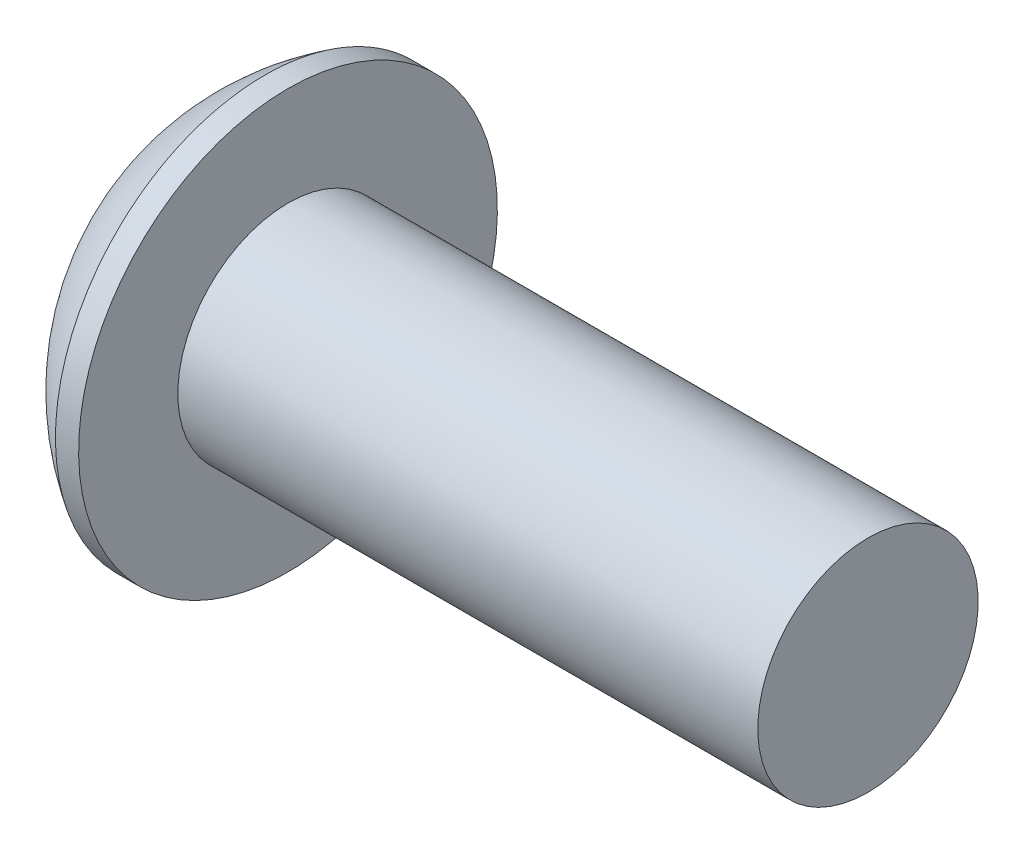
ISO-10303-21;
HEADER;
FILE_DESCRIPTION(('STEP AP214'),'2;1');
FILE_NAME('part.step','',(''),(''),'','','');
FILE_SCHEMA(('AUTOMOTIVE_DESIGN { 1 0 10303 214 1 1 1 1 }'));
ENDSEC;
DATA;
#1=APPLICATION_CONTEXT('core data for automotive mechanical design processes');
#2=APPLICATION_PROTOCOL_DEFINITION('international standard','automotive_design',2000,#1);
#3=PRODUCT_CONTEXT('',#1,'mechanical');
#4=PRODUCT('Part','Part','',(#3));
#5=PRODUCT_RELATED_PRODUCT_CATEGORY('part','',(#4));
#6=PRODUCT_DEFINITION_FORMATION('','',#4);
#7=PRODUCT_DEFINITION_CONTEXT('part definition',#1,'design');
#8=PRODUCT_DEFINITION('design','',#6,#7);
#9=PRODUCT_DEFINITION_SHAPE('','',#8);
#10=(LENGTH_UNIT() NAMED_UNIT(*) SI_UNIT(.MILLI.,.METRE.));
#11=(NAMED_UNIT(*) PLANE_ANGLE_UNIT() SI_UNIT($,.RADIAN.));
#12=(NAMED_UNIT(*) SI_UNIT($,.STERADIAN.) SOLID_ANGLE_UNIT());
#13=UNCERTAINTY_MEASURE_WITH_UNIT(LENGTH_MEASURE(1.E-05),#10,'distance_accuracy_value','');
#14=(GEOMETRIC_REPRESENTATION_CONTEXT(3) GLOBAL_UNCERTAINTY_ASSIGNED_CONTEXT((#13)) GLOBAL_UNIT_ASSIGNED_CONTEXT((#10,
#11,#12)) REPRESENTATION_CONTEXT('',''));
#15=CARTESIAN_POINT('',(0.,0.,0.));
#16=DIRECTION('',(0.,0.,1.));
#17=DIRECTION('',(1.,0.,0.));
#18=AXIS2_PLACEMENT_3D('',#15,#16,#17);
#19=CARTESIAN_POINT('',(-0.533400000000002,0.,0.));
#20=DIRECTION('',(-1.,0.,0.));
#21=DIRECTION('',(0.,0.,1.));
#22=AXIS2_PLACEMENT_3D('',#19,#20,#21);
#23=PLANE('',#22);
#24=DIRECTION('',(0.,0.5,0.866025403784439));
#25=VECTOR('',#24,1.);
#26=CARTESIAN_POINT('',(-0.533400000000002,1.83308710467706,0.));
#27=LINE('',#26,#25);
#28=CARTESIAN_POINT('',(-0.533400000000002,1.83308710467706,0.));
#29=VERTEX_POINT('',#28);
#30=CARTESIAN_POINT('',(-0.533400000000002,0.916543552338531,-1.5875));
#31=VERTEX_POINT('',#30);
#32=EDGE_CURVE('E114',#29,#31,#27,.F.);
#33=ORIENTED_EDGE('',*,*,#32,.T.);
#34=DIRECTION('',(0.,1.,0.));
#35=VECTOR('',#34,1.);
#36=CARTESIAN_POINT('',(-0.533400000000002,0.916543552338531,-1.5875));
#37=LINE('',#36,#35);
#38=CARTESIAN_POINT('',(-0.533400000000002,-0.916543552338531,-1.5875));
#39=VERTEX_POINT('',#38);
#40=EDGE_CURVE('E81',#31,#39,#37,.F.);
#41=ORIENTED_EDGE('',*,*,#40,.T.);
#42=DIRECTION('',(0.,0.5,-0.866025403784439));
#43=VECTOR('',#42,1.);
#44=CARTESIAN_POINT('',(-0.533400000000002,-0.916543552338531,-1.5875));
#45=LINE('',#44,#43);
#46=CARTESIAN_POINT('',(-0.533400000000002,-1.83308710467706,0.));
#47=VERTEX_POINT('',#46);
#48=EDGE_CURVE('E83',#39,#47,#45,.F.);
#49=ORIENTED_EDGE('',*,*,#48,.T.);
#50=DIRECTION('',(0.,-0.5,-0.866025403784439));
#51=VECTOR('',#50,1.);
#52=CARTESIAN_POINT('',(-0.533400000000002,-1.83308710467706,0.));
#53=LINE('',#52,#51);
#54=CARTESIAN_POINT('',(-0.533400000000002,-0.916543552338533,1.5875));
#55=VERTEX_POINT('',#54);
#56=EDGE_CURVE('E84',#47,#55,#53,.F.);
#57=ORIENTED_EDGE('',*,*,#56,.T.);
#58=DIRECTION('',(0.,-1.,0.));
#59=VECTOR('',#58,1.);
#60=CARTESIAN_POINT('',(-0.533400000000002,-0.916543552338532,1.5875));
#61=LINE('',#60,#59);
#62=CARTESIAN_POINT('',(-0.533400000000002,0.916543552338531,1.5875));
#63=VERTEX_POINT('',#62);
#64=EDGE_CURVE('E70',#55,#63,#61,.F.);
#65=ORIENTED_EDGE('',*,*,#64,.T.);
#66=DIRECTION('',(0.,-0.5,0.866025403784439));
#67=VECTOR('',#66,1.);
#68=CARTESIAN_POINT('',(-0.533400000000002,0.916543552338531,1.5875));
#69=LINE('',#68,#67);
#70=EDGE_CURVE('E109',#63,#29,#69,.F.);
#71=ORIENTED_EDGE('',*,*,#70,.T.);
#72=EDGE_LOOP('',(#33,#41,#49,#57,#65,#71));
#73=FACE_BOUND('',#72,.T.);
#74=ADVANCED_FACE('F16',(#73),#23,.T.);
#75=CARTESIAN_POINT('',(-0.533400000000002,-1.83308710467706,0.));
#76=DIRECTION('',(0.,-0.866025403784439,0.5));
#77=DIRECTION('',(0.,-0.5,-0.866025403784439));
#78=AXIS2_PLACEMENT_3D('',#75,#76,#77);
#79=PLANE('',#78);
#80=CARTESIAN_POINT('',(-2.56539999994394,-1.8330871046745,-2.00804498786736E-11));
#81=CARTESIAN_POINT('',(-2.53392818229741,-1.80158505518366,0.0545631502562923));
#82=CARTESIAN_POINT('',(-2.5043050627177,-1.76955629074211,0.110038597579172));
#83=CARTESIAN_POINT('',(-2.45006639539122,-1.70424635317817,0.223158727683824));
#84=CARTESIAN_POINT('',(-2.42548101615987,-1.6709589724711,0.280814162317604));
#85=CARTESIAN_POINT('',(-2.38336609605347,-1.60383660211837,0.397073518091736));
#86=CARTESIAN_POINT('',(-2.36573072948629,-1.57001869730198,0.455647847439699));
#87=CARTESIAN_POINT('',(-2.33856008862263,-1.50163859306838,0.574085662199493));
#88=CARTESIAN_POINT('',(-2.32900454007239,-1.46707848106388,0.633945532106421));
#89=CARTESIAN_POINT('',(-2.32038274183869,-1.40751253669323,0.737116774157155));
#90=CARTESIAN_POINT('',(-2.31910682172836,-1.38258360390154,0.780294952330845));
#91=CARTESIAN_POINT('',(-2.32125913780735,-1.33276652395073,0.866580665890379));
#92=CARTESIAN_POINT('',(-2.32468902284537,-1.30787839414808,0.90968817121394));
#93=CARTESIAN_POINT('',(-2.33605631415915,-1.25834345643267,0.995485200086784));
#94=CARTESIAN_POINT('',(-2.34399762019329,-1.23369687609494,1.03817432946455));
#95=CARTESIAN_POINT('',(-2.36395627681902,-1.18481740842653,1.12283605091316));
#96=CARTESIAN_POINT('',(-2.37597537628367,-1.16058470328902,1.16480832741616));
#97=CARTESIAN_POINT('',(-2.41164383187845,-1.09853862948576,1.27227527965358));
#98=CARTESIAN_POINT('',(-2.43797770752625,-1.06110942924036,1.33710455616529));
#99=CARTESIAN_POINT('',(-2.48243061452926,-1.00607390269188,1.43242888436855));
#100=CARTESIAN_POINT('',(-2.49804835924321,-0.987937988038022,1.46384120999077));
#101=CARTESIAN_POINT('',(-2.53070945051393,-0.951999508520197,1.52608848246242));
#102=CARTESIAN_POINT('',(-2.54775211871235,-0.934196789917587,1.55692369559499));
#103=CARTESIAN_POINT('',(-2.56539999993807,-0.916543552329633,1.58750000001541));
#104=B_SPLINE_CURVE_WITH_KNOTS('',3,(#80,#81,#82,#83,#84,#85,#86,#87,#88,#89,#90,#91,#92,#93,
#94,#95,#96,#97,#98,#99,#100,#101,#102,#103),.UNSPECIFIED.,.F.,.F.,(4,2,2,2,2,2,2,2,2,2,2,4),
(0.,0.211427927732169,0.424087197148228,0.633370156422424,0.842126401515785,0.991537201098734,
1.14100036552056,1.29059292577265,1.44024972414947,1.67781721417335,1.79627069411587,
1.91466809995991),.UNSPECIFIED.);
#105=CARTESIAN_POINT('',(-2.56539999993857,-1.83308710468646,0.));
#106=VERTEX_POINT('',#105);
#107=CARTESIAN_POINT('',(-2.56539999993106,-0.916543552342318,1.5875));
#108=VERTEX_POINT('',#107);
#109=EDGE_CURVE('E19',#106,#108,#104,.T.);
#110=ORIENTED_EDGE('',*,*,#109,.T.);
#111=DIRECTION('',(1.,0.,0.));
#112=VECTOR('',#111,1.);
#113=CARTESIAN_POINT('',(-0.533400000000002,-0.916543552338533,1.5875));
#114=LINE('',#113,#112);
#115=EDGE_CURVE('E89',#108,#55,#114,.T.);
#116=ORIENTED_EDGE('',*,*,#115,.T.);
#117=ORIENTED_EDGE('',*,*,#56,.F.);
#118=DIRECTION('',(1.,0.,0.));
#119=VECTOR('',#118,1.);
#120=CARTESIAN_POINT('',(-0.533400000000002,-1.83308710467706,0.));
#121=LINE('',#120,#119);
#122=EDGE_CURVE('E57',#47,#106,#121,.F.);
#123=ORIENTED_EDGE('',*,*,#122,.T.);
#124=EDGE_LOOP('',(#110,#116,#117,#123));
#125=FACE_BOUND('',#124,.T.);
#126=ADVANCED_FACE('F88',(#125),#79,.F.);
#127=CARTESIAN_POINT('',(-0.533400000000002,-0.916543552338531,-1.5875));
#128=DIRECTION('',(0.,-0.866025403784439,-0.5));
#129=DIRECTION('',(0.,0.5,-0.866025403784439));
#130=AXIS2_PLACEMENT_3D('',#127,#128,#129);
#131=PLANE('',#130);
#132=CARTESIAN_POINT('',(-2.56539999994527,-0.916543552319403,-1.58750000001409));
#133=CARTESIAN_POINT('',(-2.53392818229919,-0.948045601822691,-1.53293684974403));
#134=CARTESIAN_POINT('',(-2.50430506271949,-0.980074366269487,-1.47746140242354));
#135=CARTESIAN_POINT('',(-2.45006639539264,-1.04538430383757,-1.36434127232016));
#136=CARTESIAN_POINT('',(-2.42548101616093,-1.07867168454351,-1.30668583768523));
#137=CARTESIAN_POINT('',(-2.38336609605398,-1.14579405489574,-1.19042648190974));
#138=CARTESIAN_POINT('',(-2.36573072948662,-1.17961195971273,-1.13185215256154));
#139=CARTESIAN_POINT('',(-2.3385600886227,-1.2479920639471,-1.013414337801));
#140=CARTESIAN_POINT('',(-2.32900454007237,-1.28255217595175,-0.953554467893575));
#141=CARTESIAN_POINT('',(-2.32038274183866,-1.34211812032265,-0.850383225842316));
#142=CARTESIAN_POINT('',(-2.31910682172835,-1.36704705311438,-0.807205047668587));
#143=CARTESIAN_POINT('',(-2.32125913780739,-1.41686413306525,-0.720919334108961));
#144=CARTESIAN_POINT('',(-2.32468902284544,-1.44175226286793,-0.67781182878535));
#145=CARTESIAN_POINT('',(-2.33605631415929,-1.49128720058339,-0.592014799912417));
#146=CARTESIAN_POINT('',(-2.34399762019345,-1.51593378092113,-0.54932567053461));
#147=CARTESIAN_POINT('',(-2.36395627681926,-1.56481324858959,-0.464663949085931));
#148=CARTESIAN_POINT('',(-2.37597537628395,-1.58904595372712,-0.422691672582891));
#149=CARTESIAN_POINT('',(-2.41164383187876,-1.65109202753029,-0.315224720345625));
#150=CARTESIAN_POINT('',(-2.43797770752652,-1.6885212277756,-0.250395443834082));
#151=CARTESIAN_POINT('',(-2.48243061452944,-1.74355675432393,-0.15507111563107));
#152=CARTESIAN_POINT('',(-2.49804835924337,-1.76169266897775,-0.123658790008927));
#153=CARTESIAN_POINT('',(-2.53070945051401,-1.79763114849548,-0.0614115175374324));
#154=CARTESIAN_POINT('',(-2.5477521187124,-1.81543386709805,-0.0305763044049344));
#155=CARTESIAN_POINT('',(-2.56539999993807,-1.83308710468596,1.54136844652939E-11));
#156=B_SPLINE_CURVE_WITH_KNOTS('',3,(#132,#133,#134,#135,#136,#137,#138,#139,#140,#141,#142,
#143,#144,#145,#146,#147,#148,#149,#150,#151,#152,#153,#154,#155),.UNSPECIFIED.,.F.,.F.,(4,2,2,
2,2,2,2,2,2,2,2,4),(0.,0.211427927733669,0.424087197151313,0.633370156427101,0.842126401522016,
0.99153720110513,1.14100036552713,1.29059292577937,1.44024972415633,1.67781721417961,
1.79627069412184,1.9146680999656),.UNSPECIFIED.);
#157=CARTESIAN_POINT('',(-2.56539999995198,-0.916543552351339,-1.58750000002218));
#158=VERTEX_POINT('',#157);
#159=EDGE_CURVE('E93',#158,#106,#156,.T.);
#160=ORIENTED_EDGE('',*,*,#159,.T.);
#161=ORIENTED_EDGE('',*,*,#122,.F.);
#162=ORIENTED_EDGE('',*,*,#48,.F.);
#163=DIRECTION('',(-1.,0.,0.));
#164=VECTOR('',#163,1.);
#165=CARTESIAN_POINT('',(-0.533400000000002,-0.916543552338531,-1.5875));
#166=LINE('',#165,#164);
#167=EDGE_CURVE('E95',#39,#158,#166,.T.);
#168=ORIENTED_EDGE('',*,*,#167,.T.);
#169=EDGE_LOOP('',(#160,#161,#162,#168));
#170=FACE_BOUND('',#169,.T.);
#171=ADVANCED_FACE('F91',(#170),#131,.F.);
#172=CARTESIAN_POINT('',(-0.533400000000002,0.916543552338531,-1.5875));
#173=DIRECTION('',(0.,0.,-1.));
#174=DIRECTION('',(-1.,0.,0.));
#175=AXIS2_PLACEMENT_3D('',#172,#173,#174);
#176=PLANE('',#175);
#177=CARTESIAN_POINT('',(-2.56539999994527,0.916543552360294,-1.58749999999048));
#178=CARTESIAN_POINT('',(-2.53392818229821,0.853539453376781,-1.58749999999657));
#179=CARTESIAN_POINT('',(-2.50430506271702,0.789481924500113,-1.58749999999908));
#180=CARTESIAN_POINT('',(-2.45006639538581,0.658862049392287,-1.58750000000093));
#181=CARTESIAN_POINT('',(-2.42548101615122,0.59228728799181,-1.58750000000025));
#182=CARTESIAN_POINT('',(-2.38336609603683,0.458042547310979,-1.58749999999976));
#183=CARTESIAN_POINT('',(-2.36573072946494,0.390406737689213,-1.58749999999994));
#184=CARTESIAN_POINT('',(-2.3385600885904,0.253646529243895,-1.58750000000006));
#185=CARTESIAN_POINT('',(-2.32900454003397,0.184526305245804,-1.58750000000001));
#186=CARTESIAN_POINT('',(-2.32038274178942,0.0653944165301613,-1.58749999999999));
#187=CARTESIAN_POINT('',(-2.31910682167392,0.0155365509618711,-1.5875));
#188=CARTESIAN_POINT('',(-2.3212591377409,-0.0840976089101244,-1.5875));
#189=CARTESIAN_POINT('',(-2.32468902277208,-0.133873868500894,-1.5875));
#190=CARTESIAN_POINT('',(-2.33605631407098,-0.2329437439033,-1.5875));
#191=CARTESIAN_POINT('',(-2.34399762009707,-0.282236904564879,-1.5875));
#192=CARTESIAN_POINT('',(-2.36395627670599,-0.379995839874564,-1.5875));
#193=CARTESIAN_POINT('',(-2.37597537616188,-0.428461250136325,-1.5875));
#194=CARTESIAN_POINT('',(-2.41164383175616,-0.552553397787632,-1.5875));
#195=CARTESIAN_POINT('',(-2.43797770742117,-0.627411798334259,-1.5875));
#196=CARTESIAN_POINT('',(-2.48243061445881,-0.737482851511091,-1.5875));
#197=CARTESIAN_POINT('',(-2.49804835918582,-0.773754680844889,-1.5875));
#198=CARTESIAN_POINT('',(-2.53070945048496,-0.845631639931401,-1.5875));
#199=CARTESIAN_POINT('',(-2.54775211869874,-0.881237077161412,-1.5875));
#200=CARTESIAN_POINT('',(-2.56539999994071,-0.916543552361606,-1.5875));
#201=B_SPLINE_CURVE_WITH_KNOTS('',3,(#177,#178,#179,#180,#181,#182,#183,#184,#185,#186,#187,
#188,#189,#190,#191,#192,#193,#194,#195,#196,#197,#198,#199,#200),.UNSPECIFIED.,.F.,.F.,(4,2,2,
2,2,2,2,2,2,2,2,4),(0.,0.211427927701375,0.424087197086717,0.633370156331471,0.842126401395377,
0.991537200933545,1.14100036531054,1.29059292551773,1.44024972384963,1.677817214047,
1.79627069407681,1.91466810000777),.UNSPECIFIED.);
#202=CARTESIAN_POINT('',(-2.56539999995198,0.916543552337129,-1.58749999999757));
#203=VERTEX_POINT('',#202);
#204=EDGE_CURVE('E197',#203,#158,#201,.T.);
#205=ORIENTED_EDGE('',*,*,#204,.T.);
#206=ORIENTED_EDGE('',*,*,#167,.F.);
#207=ORIENTED_EDGE('',*,*,#40,.F.);
#208=DIRECTION('',(1.,0.,0.));
#209=VECTOR('',#208,1.);
#210=CARTESIAN_POINT('',(-0.533400000000002,0.916543552338531,-1.5875));
#211=LINE('',#210,#209);
#212=EDGE_CURVE('E111',#31,#203,#211,.F.);
#213=ORIENTED_EDGE('',*,*,#212,.T.);
#214=EDGE_LOOP('',(#205,#206,#207,#213));
#215=FACE_BOUND('',#214,.T.);
#216=ADVANCED_FACE('F187',(#215),#176,.F.);
#217=CARTESIAN_POINT('',(-0.533400000000002,1.83308710467706,0.));
#218=DIRECTION('',(0.,0.866025403784439,-0.5));
#219=DIRECTION('',(0.,0.5,0.866025403784439));
#220=AXIS2_PLACEMENT_3D('',#217,#218,#219);
#221=PLANE('',#220);
#222=CARTESIAN_POINT('',(-2.56539999994394,1.8330871046745,2.00800374309997E-11));
#223=CARTESIAN_POINT('',(-2.5339281822974,1.80158505518366,-0.0545631502562965));
#224=CARTESIAN_POINT('',(-2.5043050627177,1.76955629074211,-0.11003859757918));
#225=CARTESIAN_POINT('',(-2.45006639539121,1.70424635317816,-0.22315872768384));
#226=CARTESIAN_POINT('',(-2.42548101615987,1.67095897247109,-0.280814162317626));
#227=CARTESIAN_POINT('',(-2.38336609605347,1.60383660211835,-0.397073518091758));
#228=CARTESIAN_POINT('',(-2.36573072948628,1.57001869730197,-0.455647847439717));
#229=CARTESIAN_POINT('',(-2.33856008862263,1.50163859306837,-0.574085662199503));
#230=CARTESIAN_POINT('',(-2.32900454007239,1.46707848106388,-0.633945532106426));
#231=CARTESIAN_POINT('',(-2.32038274183869,1.40751253669322,-0.737116774157154));
#232=CARTESIAN_POINT('',(-2.31910682172836,1.38258360390154,-0.780294952330843));
#233=CARTESIAN_POINT('',(-2.32125913780735,1.33276652395073,-0.866580665890374));
#234=CARTESIAN_POINT('',(-2.32468902284537,1.30787839414808,-0.909688171213933));
#235=CARTESIAN_POINT('',(-2.33605631415915,1.25834345643267,-0.995485200086777));
#236=CARTESIAN_POINT('',(-2.34399762019328,1.23369687609495,-1.03817432946455));
#237=CARTESIAN_POINT('',(-2.36395627681902,1.18481740842653,-1.12283605091316));
#238=CARTESIAN_POINT('',(-2.37597537628367,1.16058470328902,-1.16480832741616));
#239=CARTESIAN_POINT('',(-2.41164383187872,1.09853862948529,-1.2722752796544));
#240=CARTESIAN_POINT('',(-2.43797770752691,1.06110942923942,-1.33710455616691));
#241=CARTESIAN_POINT('',(-2.48243061453059,1.00607390269029,-1.43242888437131));
#242=CARTESIAN_POINT('',(-2.49804835924479,0.987937988036214,-1.4638412099939));
#243=CARTESIAN_POINT('',(-2.53070945051602,0.951999508517968,-1.52608848246628));
#244=CARTESIAN_POINT('',(-2.54775211871471,0.934196789915152,-1.55692369559921));
#245=CARTESIAN_POINT('',(-2.56539999994071,0.916543552326994,-1.58750000001998));
#246=B_SPLINE_CURVE_WITH_KNOTS('',3,(#222,#223,#224,#225,#226,#227,#228,#229,#230,#231,#232,
#233,#234,#235,#236,#237,#238,#239,#240,#241,#242,#243,#244,#245),.UNSPECIFIED.,.F.,.F.,(4,2,2,
2,2,2,2,2,2,2,2,4),(0.,0.211427927732185,0.424087197148259,0.63337015642244,0.842126401515786,
0.99153720109873,1.14100036552055,1.29059292577265,1.44024972414947,1.67781721417631,
1.7962706941203,1.9146680999658),.UNSPECIFIED.);
#247=CARTESIAN_POINT('',(-2.56539999993857,1.83308710468646,0.));
#248=VERTEX_POINT('',#247);
#249=EDGE_CURVE('E191',#248,#203,#246,.T.);
#250=ORIENTED_EDGE('',*,*,#249,.T.);
#251=ORIENTED_EDGE('',*,*,#212,.F.);
#252=ORIENTED_EDGE('',*,*,#32,.F.);
#253=DIRECTION('',(1.,0.,0.));
#254=VECTOR('',#253,1.);
#255=CARTESIAN_POINT('',(-0.533400000000002,1.83308710467706,0.));
#256=LINE('',#255,#254);
#257=EDGE_CURVE('E106',#29,#248,#256,.F.);
#258=ORIENTED_EDGE('',*,*,#257,.T.);
#259=EDGE_LOOP('',(#250,#251,#252,#258));
#260=FACE_BOUND('',#259,.T.);
#261=ADVANCED_FACE('F183',(#260),#221,.F.);
#262=CARTESIAN_POINT('',(-0.533400000000002,0.916543552338531,1.5875));
#263=DIRECTION('',(0.,0.866025403784439,0.5));
#264=DIRECTION('',(0.,-0.5,0.866025403784439));
#265=AXIS2_PLACEMENT_3D('',#262,#263,#264);
#266=PLANE('',#265);
#267=CARTESIAN_POINT('',(-2.56539999994394,0.91654355231986,1.58750000000782));
#268=CARTESIAN_POINT('',(-2.53392818229741,0.948045601824288,1.5329368497393));
#269=CARTESIAN_POINT('',(-2.5043050627177,0.980074366271431,1.47746140241964));
#270=CARTESIAN_POINT('',(-2.45006639539122,1.04538430383949,1.36434127231737));
#271=CARTESIAN_POINT('',(-2.42548101615987,1.07867168454504,1.30668583768271));
#272=CARTESIAN_POINT('',(-2.38336609605347,1.14579405489669,1.19042648190795));
#273=CARTESIAN_POINT('',(-2.36573072948629,1.17961195971347,1.13185215256022));
#274=CARTESIAN_POINT('',(-2.33856008862263,1.24799206394736,1.01341433780059));
#275=CARTESIAN_POINT('',(-2.32900454007239,1.28255217595174,0.953554467893597));
#276=CARTESIAN_POINT('',(-2.32038274183869,1.34211812032234,0.850383225842832));
#277=CARTESIAN_POINT('',(-2.31910682172836,1.36704705311405,0.807205047669152));
#278=CARTESIAN_POINT('',(-2.32125913780735,1.41686413306487,0.720919334109624));
#279=CARTESIAN_POINT('',(-2.32468902284537,1.44175226286752,0.677811828786061));
#280=CARTESIAN_POINT('',(-2.33605631415915,1.49128720058292,0.592014799913215));
#281=CARTESIAN_POINT('',(-2.34399762019328,1.51593378092065,0.549325670535446));
#282=CARTESIAN_POINT('',(-2.36395627681902,1.56481324858906,0.464663949086841));
#283=CARTESIAN_POINT('',(-2.37597537628367,1.58904595372657,0.422691672583837));
#284=CARTESIAN_POINT('',(-2.41164383187845,1.65109202752983,0.315224720346425));
#285=CARTESIAN_POINT('',(-2.43797770752625,1.68852122777524,0.250395443834706));
#286=CARTESIAN_POINT('',(-2.48243061452926,1.74355675432371,0.155071115631445));
#287=CARTESIAN_POINT('',(-2.49804835924321,1.76169266897757,0.123658790009225));
#288=CARTESIAN_POINT('',(-2.53070945051393,1.7976311484954,0.0614115175375789));
#289=CARTESIAN_POINT('',(-2.54775211871235,1.81543386709801,0.0305763044050067));
#290=CARTESIAN_POINT('',(-2.56539999993807,1.83308710468596,-1.54142580803093E-11));
#291=B_SPLINE_CURVE_WITH_KNOTS('',3,(#267,#268,#269,#270,#271,#272,#273,#274,#275,#276,#277,
#278,#279,#280,#281,#282,#283,#284,#285,#286,#287,#288,#289,#290),.UNSPECIFIED.,.F.,.F.,(4,2,2,
2,2,2,2,2,2,2,2,4),(0.,0.211427927732169,0.424087197148227,0.633370156422423,0.842126401515785,
0.991537201098733,1.14100036552056,1.29059292577265,1.44024972414946,1.67781721417335,
1.79627069411587,1.91466809995991),.UNSPECIFIED.);
#292=CARTESIAN_POINT('',(-2.56539999993857,0.91654355234323,1.58750000000814));
#293=VERTEX_POINT('',#292);
#294=EDGE_CURVE('E165',#293,#248,#291,.T.);
#295=ORIENTED_EDGE('',*,*,#294,.T.);
#296=ORIENTED_EDGE('',*,*,#257,.F.);
#297=ORIENTED_EDGE('',*,*,#70,.F.);
#298=DIRECTION('',(1.,0.,0.));
#299=VECTOR('',#298,1.);
#300=CARTESIAN_POINT('',(-0.533400000000002,0.916543552338531,1.5875));
#301=LINE('',#300,#299);
#302=EDGE_CURVE('E38',#63,#293,#301,.F.);
#303=ORIENTED_EDGE('',*,*,#302,.T.);
#304=EDGE_LOOP('',(#295,#296,#297,#303));
#305=FACE_BOUND('',#304,.T.);
#306=ADVANCED_FACE('F176',(#305),#266,.F.);
#307=CARTESIAN_POINT('',(-0.533400000000002,-0.916543552338532,1.5875));
#308=DIRECTION('',(0.,0.,1.));
#309=DIRECTION('',(0.,-1.,0.));
#310=AXIS2_PLACEMENT_3D('',#307,#308,#309);
#311=PLANE('',#310);
#312=CARTESIAN_POINT('',(-2.56539999994394,-0.916543552354642,1.58749999998774));
#313=CARTESIAN_POINT('',(-2.53392818229741,-0.853539453359365,1.58749999999559));
#314=CARTESIAN_POINT('',(-2.50430506271771,-0.789481924470656,1.58749999999882));
#315=CARTESIAN_POINT('',(-2.45006639539122,-0.658862049338629,1.58750000000119));
#316=CARTESIAN_POINT('',(-2.42548101615988,-0.592287287925995,1.58750000000032));
#317=CARTESIAN_POINT('',(-2.38336609605349,-0.458042547221593,1.58749999999969));
#318=CARTESIAN_POINT('',(-2.36573072948631,-0.390406737588416,1.58749999999992));
#319=CARTESIAN_POINT('',(-2.33856008862266,-0.253646529120892,1.58750000000008));
#320=CARTESIAN_POINT('',(-2.32900454007243,-0.184526305112002,1.58750000000002));
#321=CARTESIAN_POINT('',(-2.32038274183874,-0.065394416370719,1.58749999999999));
#322=CARTESIAN_POINT('',(-2.31910682172841,-0.0155365507873145,1.5875));
#323=CARTESIAN_POINT('',(-2.32125913780742,0.0840976091143436,1.5875));
#324=CARTESIAN_POINT('',(-2.32468902284545,0.133873868719661,1.5875));
#325=CARTESIAN_POINT('',(-2.33605631415924,0.232943744150505,1.5875));
#326=CARTESIAN_POINT('',(-2.34399762019338,0.282236904825971,1.5875));
#327=CARTESIAN_POINT('',(-2.36395627681913,0.379995840162817,1.5875));
#328=CARTESIAN_POINT('',(-2.37597537628379,0.428461250437852,1.5875));
#329=CARTESIAN_POINT('',(-2.41164383187857,0.552553398044325,1.5875));
#330=CARTESIAN_POINT('',(-2.43797770752636,0.627411798535089,1.5875));
#331=CARTESIAN_POINT('',(-2.48243061452933,0.737482851631955,1.5875));
#332=CARTESIAN_POINT('',(-2.49804835924327,0.773754680939651,1.5875));
#333=CARTESIAN_POINT('',(-2.53070945051396,0.84563163997525,1.5875));
#334=CARTESIAN_POINT('',(-2.54775211871237,0.881237077180446,1.5875));
#335=CARTESIAN_POINT('',(-2.56539999993807,0.91654355235633,1.5875));
#336=B_SPLINE_CURVE_WITH_KNOTS('',3,(#312,#313,#314,#315,#316,#317,#318,#319,#320,#321,#322,
#323,#324,#325,#326,#327,#328,#329,#330,#331,#332,#333,#334,#335),.UNSPECIFIED.,.F.,.F.,(4,2,2,
2,2,2,2,2,2,2,2,4),(0.,0.211427927732202,0.424087197148294,0.633370156422521,0.842126401515914,
0.991537201098908,1.14100036552078,1.29059292577292,1.44024972414978,1.67781721417349,
1.79627069411592,1.91466809995988),.UNSPECIFIED.);
#337=EDGE_CURVE('E157',#108,#293,#336,.T.);
#338=ORIENTED_EDGE('',*,*,#337,.T.);
#339=ORIENTED_EDGE('',*,*,#302,.F.);
#340=ORIENTED_EDGE('',*,*,#64,.F.);
#341=ORIENTED_EDGE('',*,*,#115,.F.);
#342=EDGE_LOOP('',(#338,#339,#340,#341));
#343=FACE_BOUND('',#342,.T.);
#344=ADVANCED_FACE('F172',(#343),#311,.F.);
#345=CARTESIAN_POINT('',(-2.56540000003724,0.,0.));
#346=DIRECTION('',(-1.,0.,0.));
#347=DIRECTION('',(0.,-1.,0.));
#348=AXIS2_PLACEMENT_3D('',#345,#346,#347);
#349=CONICAL_SURFACE('',#348,1.83308710478514,0.78539816351237);
#350=ORIENTED_EDGE('',*,*,#109,.F.);
#351=CARTESIAN_POINT('',(-2.56539999992356,0.,0.));
#352=DIRECTION('',(-1.,0.,0.));
#353=DIRECTION('',(0.,-1.,0.));
#354=AXIS2_PLACEMENT_3D('',#351,#352,#353);
#355=CIRCLE('',#354,1.83308710467145);
#356=EDGE_CURVE('E164',#108,#106,#355,.F.);
#357=ORIENTED_EDGE('',*,*,#356,.F.);
#358=EDGE_LOOP('',(#350,#357));
#359=FACE_BOUND('',#358,.T.);
#360=ADVANCED_FACE('F175',(#359),#349,.F.);
#361=CARTESIAN_POINT('',(-2.56540000003724,0.,0.));
#362=DIRECTION('',(-1.,0.,0.));
#363=DIRECTION('',(0.,-1.,0.));
#364=AXIS2_PLACEMENT_3D('',#361,#362,#363);
#365=CONICAL_SURFACE('',#364,1.83308710478514,0.78539816351237);
#366=ORIENTED_EDGE('',*,*,#159,.F.);
#367=CARTESIAN_POINT('',(-2.56539999992356,0.,0.));
#368=DIRECTION('',(-1.,0.,0.));
#369=DIRECTION('',(0.,-1.,0.));
#370=AXIS2_PLACEMENT_3D('',#367,#368,#369);
#371=CIRCLE('',#370,1.83308710467145);
#372=EDGE_CURVE('E271',#106,#158,#371,.F.);
#373=ORIENTED_EDGE('',*,*,#372,.F.);
#374=EDGE_LOOP('',(#366,#373));
#375=FACE_BOUND('',#374,.T.);
#376=ADVANCED_FACE('F209',(#375),#365,.F.);
#377=CARTESIAN_POINT('',(-2.56540000003724,0.,0.));
#378=DIRECTION('',(-1.,0.,0.));
#379=DIRECTION('',(0.,-1.,0.));
#380=AXIS2_PLACEMENT_3D('',#377,#378,#379);
#381=CONICAL_SURFACE('',#380,1.83308710478514,0.785398163397448);
#382=ORIENTED_EDGE('',*,*,#204,.F.);
#383=CARTESIAN_POINT('',(-2.5653999999804,0.,0.));
#384=DIRECTION('',(-1.,0.,0.));
#385=DIRECTION('',(0.,-1.,0.));
#386=AXIS2_PLACEMENT_3D('',#383,#384,#385);
#387=CIRCLE('',#386,1.83308710472829);
#388=EDGE_CURVE('E268',#158,#203,#387,.F.);
#389=ORIENTED_EDGE('',*,*,#388,.F.);
#390=EDGE_LOOP('',(#382,#389));
#391=FACE_BOUND('',#390,.T.);
#392=ADVANCED_FACE('F205',(#391),#381,.F.);
#393=CARTESIAN_POINT('',(-2.56540000003724,0.,0.));
#394=DIRECTION('',(-1.,0.,0.));
#395=DIRECTION('',(0.,-1.,0.));
#396=AXIS2_PLACEMENT_3D('',#393,#394,#395);
#397=CONICAL_SURFACE('',#396,1.83308710478514,0.78539816351237);
#398=ORIENTED_EDGE('',*,*,#249,.F.);
#399=CARTESIAN_POINT('',(-2.56539999992356,0.,0.));
#400=DIRECTION('',(-1.,0.,0.));
#401=DIRECTION('',(0.,-1.,0.));
#402=AXIS2_PLACEMENT_3D('',#399,#400,#401);
#403=CIRCLE('',#402,1.83308710467145);
#404=EDGE_CURVE('E265',#203,#248,#403,.F.);
#405=ORIENTED_EDGE('',*,*,#404,.F.);
#406=EDGE_LOOP('',(#398,#405));
#407=FACE_BOUND('',#406,.T.);
#408=ADVANCED_FACE('F202',(#407),#397,.F.);
#409=CARTESIAN_POINT('',(-2.56540000003724,0.,0.));
#410=DIRECTION('',(-1.,0.,0.));
#411=DIRECTION('',(0.,-1.,0.));
#412=AXIS2_PLACEMENT_3D('',#409,#410,#411);
#413=CONICAL_SURFACE('',#412,1.83308710478514,0.78539816351237);
#414=ORIENTED_EDGE('',*,*,#294,.F.);
#415=CARTESIAN_POINT('',(-2.56539999992356,0.,0.));
#416=DIRECTION('',(-1.,0.,0.));
#417=DIRECTION('',(0.,-1.,0.));
#418=AXIS2_PLACEMENT_3D('',#415,#416,#417);
#419=CIRCLE('',#418,1.83308710467145);
#420=EDGE_CURVE('E260',#248,#293,#419,.F.);
#421=ORIENTED_EDGE('',*,*,#420,.F.);
#422=EDGE_LOOP('',(#414,#421));
#423=FACE_BOUND('',#422,.T.);
#424=ADVANCED_FACE('F152',(#423),#413,.F.);
#425=CARTESIAN_POINT('',(-2.56540000003724,0.,0.));
#426=DIRECTION('',(-1.,0.,0.));
#427=DIRECTION('',(0.,-1.,0.));
#428=AXIS2_PLACEMENT_3D('',#425,#426,#427);
#429=CONICAL_SURFACE('',#428,1.83308710478514,0.785398163512485);
#430=ORIENTED_EDGE('',*,*,#337,.F.);
#431=CARTESIAN_POINT('',(-2.56539999992356,0.,0.));
#432=DIRECTION('',(-1.,0.,0.));
#433=DIRECTION('',(0.,-1.,0.));
#434=AXIS2_PLACEMENT_3D('',#431,#432,#433);
#435=CIRCLE('',#434,1.83308710467145);
#436=EDGE_CURVE('E137',#293,#108,#435,.F.);
#437=ORIENTED_EDGE('',*,*,#436,.F.);
#438=EDGE_LOOP('',(#430,#437));
#439=FACE_BOUND('',#438,.T.);
#440=ADVANCED_FACE('F147',(#439),#429,.F.);
#441=CARTESIAN_POINT('',(-2.5654,0.,0.));
#442=DIRECTION('',(-1.,0.,0.));
#443=DIRECTION('',(0.,-1.,0.));
#444=AXIS2_PLACEMENT_3D('',#441,#442,#443);
#445=PLANE('',#444);
#446=CARTESIAN_POINT('',(-2.5654,-2.29235000000002,0.));
#447=CARTESIAN_POINT('',(-2.56540000000001,-2.29234961429958,-0.0643619991867162));
#448=CARTESIAN_POINT('',(-2.56540000000002,-2.28963695190109,-0.128735826629366));
#449=CARTESIAN_POINT('',(-2.56539999999999,-2.27880393843649,-0.257038618985287));
#450=CARTESIAN_POINT('',(-2.56539999999995,-2.27068199085128,-0.320967446929163));
#451=CARTESIAN_POINT('',(-2.56540000000006,-2.24906694794257,-0.448021254607718));
#452=CARTESIAN_POINT('',(-2.56540000000021,-2.23556532653462,-0.511144793381861));
#453=CARTESIAN_POINT('',(-2.56539999999979,-2.20328400495645,-0.636065176149322));
#454=CARTESIAN_POINT('',(-2.56539999999921,-2.18450002159115,-0.697860899533935));
#455=CARTESIAN_POINT('',(-2.56539999999869,-2.12048422735804,-0.88032980292775));
#456=CARTESIAN_POINT('',(-2.56539999999995,-2.0675359907946,-0.99839179592812));
#457=CARTESIAN_POINT('',(-2.56540000000006,-1.94254204858674,-1.22393765942148));
#458=CARTESIAN_POINT('',(-2.56539999999891,-1.87049561696644,-1.33142112758208));
#459=CARTESIAN_POINT('',(-2.56539999999932,-1.74974254194881,-1.48237719670935));
#460=CARTESIAN_POINT('',(-2.56539999999982,-1.70734573132302,-1.53101280076738));
#461=CARTESIAN_POINT('',(-2.56540000000018,-1.6186391029153,-1.62450601319185));
#462=CARTESIAN_POINT('',(-2.56540000000005,-1.57233309727313,-1.66936721890417));
#463=CARTESIAN_POINT('',(-2.56539999999995,-1.47608431707234,-1.7550488420402));
#464=CARTESIAN_POINT('',(-2.56539999999999,-1.42613990458995,-1.79586741981512));
#465=CARTESIAN_POINT('',(-2.56540000000002,-1.32299452541252,-1.87315615311523));
#466=CARTESIAN_POINT('',(-2.56540000000001,-1.26979280714188,-1.90962529930697));
#467=CARTESIAN_POINT('',(-2.56539999999999,-1.10588180153953,-2.0120772215109));
#468=CARTESIAN_POINT('',(-2.5654,-0.990764947001321,-2.07119486286667));
#469=CARTESIAN_POINT('',(-2.5654,-0.752302198839727,-2.16922858468856));
#470=CARTESIAN_POINT('',(-2.5654,-0.628956393121269,-2.2081448809145));
#471=CARTESIAN_POINT('',(-2.5654,-0.377466101733277,-2.2647275576592));
#472=CARTESIAN_POINT('',(-2.5654,-0.249321590440388,-2.28239382469379));
#473=CARTESIAN_POINT('',(-2.5654,0.0081143537161001,-2.29595665980956));
#474=CARTESIAN_POINT('',(-2.5654,0.137405786579698,-2.29185322789073));
#475=CARTESIAN_POINT('',(-2.5654,0.393449386933719,-2.2620096240906));
#476=CARTESIAN_POINT('',(-2.5654,0.520201567981077,-2.23626956775766));
#477=CARTESIAN_POINT('',(-2.5654,0.767645294384444,-2.16383549332687));
#478=CARTESIAN_POINT('',(-2.5654,0.888336774993549,-2.11714125142686));
#479=CARTESIAN_POINT('',(-2.5654,1.06210572146655,-2.03247976453654));
#480=CARTESIAN_POINT('',(-2.5654,1.11884498714066,-2.00180278323696));
#481=CARTESIAN_POINT('',(-2.5654,1.22954062855572,-1.93578011658036));
#482=CARTESIAN_POINT('',(-2.5654,1.28349764565392,-1.9004355139425));
#483=CARTESIAN_POINT('',(-2.5654,1.38821676641537,-1.82534174602348));
#484=CARTESIAN_POINT('',(-2.5654,1.43898030563028,-1.78559458231503));
#485=CARTESIAN_POINT('',(-2.5654,1.53701984534431,-1.70193996292362));
#486=CARTESIAN_POINT('',(-2.5654,1.5842924328055,-1.65802852924127));
#487=CARTESIAN_POINT('',(-2.5654,1.72023903553758,-1.52059650554139));
#488=CARTESIAN_POINT('',(-2.5654,1.80318066138239,-1.42127847626519));
#489=CARTESIAN_POINT('',(-2.5654,1.95118232345098,-1.21011519784664));
#490=CARTESIAN_POINT('',(-2.5654,2.01624303935584,-1.09827042509272));
#491=CARTESIAN_POINT('',(-2.5654,2.09907772661314,-0.923538238005839));
#492=CARTESIAN_POINT('',(-2.5654,2.12425103063558,-0.864058373981966));
#493=CARTESIAN_POINT('',(-2.5654,2.16947990046565,-0.743221562175601));
#494=CARTESIAN_POINT('',(-2.5654,2.18953960800684,-0.681866178863365));
#495=CARTESIAN_POINT('',(-2.5654,2.22438542051156,-0.557786972400356));
#496=CARTESIAN_POINT('',(-2.5654,2.23917985294818,-0.495065478128172));
#497=CARTESIAN_POINT('',(-2.5654,2.26343456384453,-0.368611258323514));
#498=CARTESIAN_POINT('',(-2.5654,2.27289641559285,-0.304878836759566));
#499=CARTESIAN_POINT('',(-2.5654,2.28388649696736,-0.200873029360621));
#500=CARTESIAN_POINT('',(-2.5654,2.28705930623293,-0.160766164180096));
#501=CARTESIAN_POINT('',(-2.5654,2.29129117827044,-0.0804410725432706));
#502=CARTESIAN_POINT('',(-2.5654,2.29235024104238,-0.0402228460869715));
#503=CARTESIAN_POINT('',(-2.56540000000001,2.29234961429956,0.0643619991867166));
#504=CARTESIAN_POINT('',(-2.56540000000002,2.28963695190107,0.128735826629366));
#505=CARTESIAN_POINT('',(-2.56539999999999,2.27880393843648,0.257038618985288));
#506=CARTESIAN_POINT('',(-2.56539999999995,2.27068199085126,0.320967446929163));
#507=CARTESIAN_POINT('',(-2.56540000000006,2.24906694794255,0.448021254607719));
#508=CARTESIAN_POINT('',(-2.56540000000021,2.2355653265346,0.511144793381862));
#509=CARTESIAN_POINT('',(-2.56539999999979,2.20328400495644,0.636065176149322));
#510=CARTESIAN_POINT('',(-2.56539999999921,2.18450002159113,0.697860899533936));
#511=CARTESIAN_POINT('',(-2.56539999999869,2.12048422735802,0.88032980292775));
#512=CARTESIAN_POINT('',(-2.56539999999995,2.06753599079459,0.998391795928119));
#513=CARTESIAN_POINT('',(-2.56540000000006,1.94254204858672,1.22393765942147));
#514=CARTESIAN_POINT('',(-2.56539999999891,1.87049561696642,1.33142112758208));
#515=CARTESIAN_POINT('',(-2.56539999999933,1.7497425419488,1.48237719670935));
#516=CARTESIAN_POINT('',(-2.56539999999982,1.707345731323,1.53101280076738));
#517=CARTESIAN_POINT('',(-2.56540000000018,1.61863910291529,1.62450601319185));
#518=CARTESIAN_POINT('',(-2.56540000000005,1.57233309727312,1.66936721890418));
#519=CARTESIAN_POINT('',(-2.56539999999995,1.47608431707233,1.75504884204021));
#520=CARTESIAN_POINT('',(-2.56539999999999,1.42613990458993,1.79586741981512));
#521=CARTESIAN_POINT('',(-2.56540000000002,1.3229945254125,1.87315615311523));
#522=CARTESIAN_POINT('',(-2.56540000000001,1.26979280714187,1.90962529930697));
#523=CARTESIAN_POINT('',(-2.56539999999999,1.10588180153952,2.0120772215109));
#524=CARTESIAN_POINT('',(-2.5654,0.990764947001304,2.07119486286667));
#525=CARTESIAN_POINT('',(-2.5654,0.75230219883971,2.16922858468856));
#526=CARTESIAN_POINT('',(-2.5654,0.628956393121252,2.2081448809145));
#527=CARTESIAN_POINT('',(-2.5654,0.377466101733262,2.2647275576592));
#528=CARTESIAN_POINT('',(-2.5654,0.249321590440372,2.28239382469379));
#529=CARTESIAN_POINT('',(-2.5654,-0.00811435371611611,2.29595665980955));
#530=CARTESIAN_POINT('',(-2.5654,-0.137405786579714,2.29185322789072));
#531=CARTESIAN_POINT('',(-2.5654,-0.393449386933735,2.2620096240906));
#532=CARTESIAN_POINT('',(-2.5654,-0.520201567981094,2.23626956775766));
#533=CARTESIAN_POINT('',(-2.5654,-0.767645294384462,2.16383549332688));
#534=CARTESIAN_POINT('',(-2.5654,-0.888336774993567,2.11714125142686));
#535=CARTESIAN_POINT('',(-2.5654,-1.06210572146657,2.03247976453654));
#536=CARTESIAN_POINT('',(-2.5654,-1.11884498714068,2.00180278323695));
#537=CARTESIAN_POINT('',(-2.5654,-1.22954062855574,1.93578011658036));
#538=CARTESIAN_POINT('',(-2.5654,-1.28349764565394,1.9004355139425));
#539=CARTESIAN_POINT('',(-2.5654,-1.38821676641539,1.82534174602348));
#540=CARTESIAN_POINT('',(-2.5654,-1.4389803056303,1.78559458231503));
#541=CARTESIAN_POINT('',(-2.5654,-1.53701984534432,1.70193996292362));
#542=CARTESIAN_POINT('',(-2.5654,-1.58429243280552,1.65802852924127));
#543=CARTESIAN_POINT('',(-2.5654,-1.7202390355376,1.52059650554139));
#544=CARTESIAN_POINT('',(-2.5654,-1.8031806613824,1.42127847626519));
#545=CARTESIAN_POINT('',(-2.5654,-1.951182323451,1.21011519784664));
#546=CARTESIAN_POINT('',(-2.5654,-2.01624303935586,1.09827042509272));
#547=CARTESIAN_POINT('',(-2.5654,-2.09907772661316,0.923538238005837));
#548=CARTESIAN_POINT('',(-2.5654,-2.1242510306356,0.864058373981964));
#549=CARTESIAN_POINT('',(-2.5654,-2.16947990046567,0.743221562175599));
#550=CARTESIAN_POINT('',(-2.5654,-2.18953960800686,0.681866178863365));
#551=CARTESIAN_POINT('',(-2.5654,-2.22438542051158,0.557786972400357));
#552=CARTESIAN_POINT('',(-2.5654,-2.2391798529482,0.495065478128172));
#553=CARTESIAN_POINT('',(-2.5654,-2.26343456384455,0.368611258323514));
#554=CARTESIAN_POINT('',(-2.5654,-2.27289641559287,0.304878836759567));
#555=CARTESIAN_POINT('',(-2.5654,-2.28388649696738,0.200873029360623));
#556=CARTESIAN_POINT('',(-2.5654,-2.28705930623295,0.160766164180096));
#557=CARTESIAN_POINT('',(-2.5654,-2.29129117827046,0.080441072543271));
#558=CARTESIAN_POINT('',(-2.5654,-2.29235024104239,0.0402228460869719));
#559=CARTESIAN_POINT('',(-2.5654,-2.29235000000002,0.));
#560=B_SPLINE_CURVE_WITH_KNOTS('',3,(#446,#447,#448,#449,#450,#451,#452,#453,#454,#455,#456,
#457,#458,#459,#460,#461,#462,#463,#464,#465,#466,#467,#468,#469,#470,#471,#472,#473,#474,#475,
#476,#477,#478,#479,#480,#481,#482,#483,#484,#485,#486,#487,#488,#489,#490,#491,#492,#493,#494,
#495,#496,#497,#498,#499,#500,#501,#502,#503,#504,#505,#506,#507,#508,#509,#510,#511,#512,#513,
#514,#515,#516,#517,#518,#519,#520,#521,#522,#523,#524,#525,#526,#527,#528,#529,#530,#531,#532,
#533,#534,#535,#536,#537,#538,#539,#540,#541,#542,#543,#544,#545,#546,#547,#548,#549,#550,#551,
#552,#553,#554,#555,#556,#557,#558,#559),.UNSPECIFIED.,.T.,.F.,(4,2,2,2,2,2,2,2,2,2,2,2,2,2,2,2,
2,2,2,2,2,2,2,2,2,2,2,2,2,2,2,2,2,2,2,2,2,2,2,2,2,2,2,2,2,2,2,2,2,2,2,2,2,2,2,2,4),(0.,
0.193048968618034,0.386154939782395,0.579568183995959,0.77313871149104,1.15935703864578,
1.54559004914645,1.73895960916369,1.93214273180064,2.12541336477222,2.31872876140889,
2.70495649282619,3.09118009906583,3.47740576789432,3.86363143672286,4.24985504296255,
4.6360827743798,4.82939817101621,5.02266880398749,5.21585192662421,5.40922148664123,
5.79545449714218,6.18167282429725,6.37524335179263,6.56865659600643,6.7617625671709,
6.9548115357891,7.07545693291923,7.19610233004938,7.38915129866742,7.58225726983178,
7.77567051404534,7.96924104154042,8.35545936869516,8.74169237919583,8.93506193921307,
9.12824506185002,9.3215156948216,9.51483109145827,9.90105882287557,10.2872824291152,
10.6735080979437,11.0597337667722,11.4459573730119,11.8321851044292,12.0255005010656,
12.2187711340369,12.4119542566736,12.6053238166906,12.9915568271916,13.3777751543466,
13.571345681842,13.7647589260558,13.9578648972203,14.1509138658385,14.2715592629686,
14.3922046600988),.UNSPECIFIED.);
#561=CARTESIAN_POINT('',(-2.5654,-2.29235000000002,0.));
#562=VERTEX_POINT('',#561);
#563=EDGE_CURVE('E130',#562,#562,#560,.T.);
#564=ORIENTED_EDGE('',*,*,#563,.F.);
#565=EDGE_LOOP('',(#564));
#566=FACE_BOUND('',#565,.T.);
#567=ORIENTED_EDGE('',*,*,#420,.T.);
#568=ORIENTED_EDGE('',*,*,#436,.T.);
#569=ORIENTED_EDGE('',*,*,#356,.T.);
#570=ORIENTED_EDGE('',*,*,#372,.T.);
#571=ORIENTED_EDGE('',*,*,#388,.T.);
#572=ORIENTED_EDGE('',*,*,#404,.T.);
#573=EDGE_LOOP('',(#567,#568,#569,#570,#571,#572));
#574=FACE_BOUND('',#573,.T.);
#575=ADVANCED_FACE('F143',(#566,#574),#445,.T.);
#576=CARTESIAN_POINT('',(2.29449606481481,0.,0.));
#577=DIRECTION('',(0.,1.,0.));
#578=DIRECTION('',(-1.,0.,0.));
#579=AXIS2_PLACEMENT_3D('',#576,#577,#578);
#580=SPHERICAL_SURFACE('',#579,5.37340285883187);
#581=ORIENTED_EDGE('',*,*,#563,.T.);
#582=EDGE_LOOP('',(#581));
#583=FACE_BOUND('',#582,.T.);
#584=CARTESIAN_POINT('',(-0.508,0.,0.));
#585=DIRECTION('',(1.,0.,0.));
#586=DIRECTION('',(0.,1.,0.));
#587=AXIS2_PLACEMENT_3D('',#584,#585,#586);
#588=CIRCLE('',#587,4.5847);
#589=CARTESIAN_POINT('',(-0.508,4.5847,0.));
#590=VERTEX_POINT('',#589);
#591=EDGE_CURVE('E127',#590,#590,#588,.T.);
#592=ORIENTED_EDGE('',*,*,#591,.F.);
#593=EDGE_LOOP('',(#592));
#594=FACE_BOUND('',#593,.T.);
#595=ADVANCED_FACE('F139',(#583,#594),#580,.T.);
#596=CARTESIAN_POINT('',(0.,0.,0.));
#597=DIRECTION('',(1.,0.,0.));
#598=DIRECTION('',(0.,1.,0.));
#599=AXIS2_PLACEMENT_3D('',#596,#597,#598);
#600=CYLINDRICAL_SURFACE('',#599,4.5847);
#601=ORIENTED_EDGE('',*,*,#591,.T.);
#602=EDGE_LOOP('',(#601));
#603=FACE_BOUND('',#602,.T.);
#604=CARTESIAN_POINT('',(0.,0.,0.));
#605=DIRECTION('',(1.,0.,0.));
#606=DIRECTION('',(0.,1.,0.));
#607=AXIS2_PLACEMENT_3D('',#604,#605,#606);
#608=CIRCLE('',#607,4.5847);
#609=CARTESIAN_POINT('',(0.,4.5847,0.));
#610=VERTEX_POINT('',#609);
#611=EDGE_CURVE('E124',#610,#610,#608,.T.);
#612=ORIENTED_EDGE('',*,*,#611,.F.);
#613=EDGE_LOOP('',(#612));
#614=FACE_BOUND('',#613,.T.);
#615=ADVANCED_FACE('F239',(#603,#614),#600,.T.);
#616=CARTESIAN_POINT('',(12.7,0.,0.));
#617=DIRECTION('',(1.,0.,0.));
#618=DIRECTION('',(0.,1.,0.));
#619=AXIS2_PLACEMENT_3D('',#616,#617,#618);
#620=PLANE('',#619);
#621=CARTESIAN_POINT('',(12.7,0.,0.));
#622=DIRECTION('',(-1.,0.,0.));
#623=DIRECTION('',(0.,-1.,0.));
#624=AXIS2_PLACEMENT_3D('',#621,#622,#623);
#625=CIRCLE('',#624,2.413);
#626=CARTESIAN_POINT('',(12.7,-2.413,0.));
#627=VERTEX_POINT('',#626);
#628=EDGE_CURVE('E29',#627,#627,#625,.T.);
#629=ORIENTED_EDGE('',*,*,#628,.F.);
#630=EDGE_LOOP('',(#629));
#631=FACE_BOUND('',#630,.T.);
#632=ADVANCED_FACE('F233',(#631),#620,.T.);
#633=CARTESIAN_POINT('',(0.,4.5847,0.));
#634=DIRECTION('',(1.,0.,0.));
#635=DIRECTION('',(0.,1.,0.));
#636=AXIS2_PLACEMENT_3D('',#633,#634,#635);
#637=PLANE('',#636);
#638=CARTESIAN_POINT('',(0.,0.,0.));
#639=DIRECTION('',(-1.,0.,0.));
#640=DIRECTION('',(0.,-1.,0.));
#641=AXIS2_PLACEMENT_3D('',#638,#639,#640);
#642=CIRCLE('',#641,2.413);
#643=CARTESIAN_POINT('',(0.,-2.413,0.));
#644=VERTEX_POINT('',#643);
#645=EDGE_CURVE('E11',#644,#644,#642,.F.);
#646=ORIENTED_EDGE('',*,*,#645,.F.);
#647=EDGE_LOOP('',(#646));
#648=FACE_BOUND('',#647,.T.);
#649=ORIENTED_EDGE('',*,*,#611,.T.);
#650=EDGE_LOOP('',(#649));
#651=FACE_BOUND('',#650,.T.);
#652=ADVANCED_FACE('F227',(#648,#651),#637,.T.);
#653=CARTESIAN_POINT('',(12.7,0.,0.));
#654=DIRECTION('',(-1.,0.,0.));
#655=DIRECTION('',(0.,-1.,0.));
#656=AXIS2_PLACEMENT_3D('',#653,#654,#655);
#657=CYLINDRICAL_SURFACE('',#656,2.413);
#658=ORIENTED_EDGE('',*,*,#645,.T.);
#659=EDGE_LOOP('',(#658));
#660=FACE_BOUND('',#659,.T.);
#661=ORIENTED_EDGE('',*,*,#628,.T.);
#662=EDGE_LOOP('',(#661));
#663=FACE_BOUND('',#662,.T.);
#664=ADVANCED_FACE('F225',(#660,#663),#657,.T.);
#665=CLOSED_SHELL('',(#74,#126,#171,#216,#261,#306,#344,#360,#376,#392,#408,#424,#440,#575,#595,
#615,#632,#652,#664));
#666=MANIFOLD_SOLID_BREP('B1',#665);
#667=ADVANCED_BREP_SHAPE_REPRESENTATION('',(#18,#666),#14);
#668=SHAPE_DEFINITION_REPRESENTATION(#9,#667);
ENDSEC;
END-ISO-10303-21;
